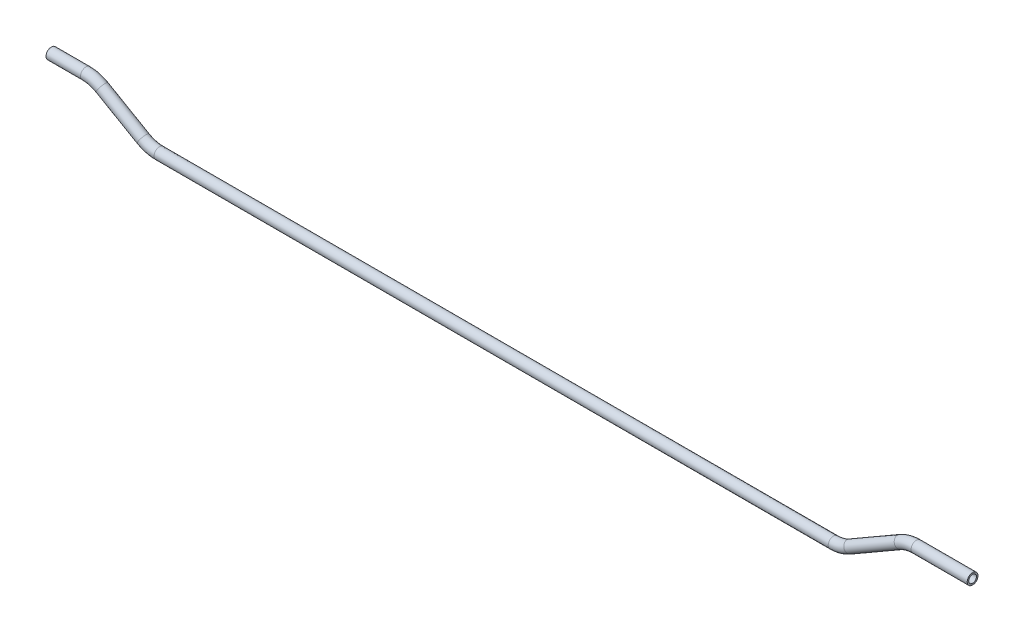
ISO-10303-21;
HEADER;
FILE_DESCRIPTION(('STEP AP214'),'2;1');
FILE_NAME('part.step','',(''),(''),'','','');
FILE_SCHEMA(('AUTOMOTIVE_DESIGN { 1 0 10303 214 1 1 1 1 }'));
ENDSEC;
DATA;
#1=APPLICATION_CONTEXT('core data for automotive mechanical design processes');
#2=APPLICATION_PROTOCOL_DEFINITION('international standard','automotive_design',2000,#1);
#3=PRODUCT_CONTEXT('',#1,'mechanical');
#4=PRODUCT('Part','Part','',(#3));
#5=PRODUCT_RELATED_PRODUCT_CATEGORY('part','',(#4));
#6=PRODUCT_DEFINITION_FORMATION('','',#4);
#7=PRODUCT_DEFINITION_CONTEXT('part definition',#1,'design');
#8=PRODUCT_DEFINITION('design','',#6,#7);
#9=PRODUCT_DEFINITION_SHAPE('','',#8);
#10=(LENGTH_UNIT() NAMED_UNIT(*) SI_UNIT(.MILLI.,.METRE.));
#11=(NAMED_UNIT(*) PLANE_ANGLE_UNIT() SI_UNIT($,.RADIAN.));
#12=(NAMED_UNIT(*) SI_UNIT($,.STERADIAN.) SOLID_ANGLE_UNIT());
#13=UNCERTAINTY_MEASURE_WITH_UNIT(LENGTH_MEASURE(1.E-05),#10,'distance_accuracy_value','');
#14=(GEOMETRIC_REPRESENTATION_CONTEXT(3) GLOBAL_UNCERTAINTY_ASSIGNED_CONTEXT((#13)) GLOBAL_UNIT_ASSIGNED_CONTEXT((#10,
#11,#12)) REPRESENTATION_CONTEXT('',''));
#15=CARTESIAN_POINT('',(0.,0.,0.));
#16=DIRECTION('',(0.,0.,1.));
#17=DIRECTION('',(1.,0.,0.));
#18=AXIS2_PLACEMENT_3D('',#15,#16,#17);
#19=CARTESIAN_POINT('',(-15.2007895417832,-14.7828746599777,0.));
#20=DIRECTION('',(1.,0.,0.));
#21=DIRECTION('',(0.,1.,0.));
#22=AXIS2_PLACEMENT_3D('',#19,#20,#21);
#23=CYLINDRICAL_SURFACE('',#22,3.175);
#24=CARTESIAN_POINT('',(5.0947783424039,-14.7828746599777,0.));
#25=DIRECTION('',(1.,0.,0.));
#26=DIRECTION('',(0.,1.,0.));
#27=AXIS2_PLACEMENT_3D('',#24,#25,#26);
#28=CIRCLE('',#27,3.175);
#29=CARTESIAN_POINT('',(5.0947783424039,-11.6078746599777,0.));
#30=VERTEX_POINT('',#29);
#31=EDGE_CURVE('E55',#30,#30,#28,.T.);
#32=ORIENTED_EDGE('',*,*,#31,.F.);
#33=EDGE_LOOP('',(#32));
#34=FACE_BOUND('',#33,.T.);
#35=CARTESIAN_POINT('',(-15.2007895417832,-14.7828746599777,0.));
#36=DIRECTION('',(1.,0.,0.));
#37=DIRECTION('',(0.,1.,0.));
#38=AXIS2_PLACEMENT_3D('',#35,#36,#37);
#39=CIRCLE('',#38,3.175);
#40=CARTESIAN_POINT('',(-15.2007895417832,-11.6078746599777,0.));
#41=VERTEX_POINT('',#40);
#42=EDGE_CURVE('E52',#41,#41,#39,.T.);
#43=ORIENTED_EDGE('',*,*,#42,.T.);
#44=EDGE_LOOP('',(#43));
#45=FACE_BOUND('',#44,.T.);
#46=ADVANCED_FACE('F31',(#34,#45),#23,.T.);
#47=CARTESIAN_POINT('',(5.0947783424039,-33.8328746599777,0.));
#48=DIRECTION('',(0.,0.,-1.));
#49=DIRECTION('',(-1.,0.,0.));
#50=AXIS2_PLACEMENT_3D('',#47,#48,#49);
#51=TOROIDAL_SURFACE('',#50,19.05,3.175);
#52=CARTESIAN_POINT('',(14.6197783424039,-17.3350907178842,0.));
#53=DIRECTION('',(0.866025403784438,-0.500000000000001,0.));
#54=DIRECTION('',(0.500000000000001,0.866025403784438,0.));
#55=AXIS2_PLACEMENT_3D('',#52,#53,#54);
#56=CIRCLE('',#55,3.175);
#57=CARTESIAN_POINT('',(16.2072783424039,-14.5854600608686,0.));
#58=VERTEX_POINT('',#57);
#59=EDGE_CURVE('E58',#58,#58,#56,.T.);
#60=CARTESIAN_POINT('',(5.0947783424039,-33.8328746599777,0.));
#61=DIRECTION('',(0.,0.,-1.));
#62=DIRECTION('',(-1.,0.,0.));
#63=AXIS2_PLACEMENT_3D('',#60,#61,#62);
#64=CIRCLE('',#63,22.225);
#65=EDGE_CURVE('',#30,#58,#64,.T.);
#66=ORIENTED_EDGE('',*,*,#31,.T.);
#67=ORIENTED_EDGE('',*,*,#59,.F.);
#68=ORIENTED_EDGE('',*,*,#65,.T.);
#69=ORIENTED_EDGE('',*,*,#65,.F.);
#70=EDGE_LOOP('',(#66,#68,#67,#69));
#71=FACE_BOUND('',#70,.T.);
#72=ADVANCED_FACE('F115',(#71),#51,.T.);
#73=CARTESIAN_POINT('',(14.6197783424039,-17.3350907178842,0.));
#74=DIRECTION('',(0.866025403784439,-0.499999999999999,0.));
#75=DIRECTION('',(0.499999999999999,0.866025403784439,0.));
#76=AXIS2_PLACEMENT_3D('',#73,#74,#75);
#77=CYLINDRICAL_SURFACE('',#76,3.175);
#78=CARTESIAN_POINT('',(38.7742104582168,-31.2806586020712,0.));
#79=DIRECTION('',(0.866025403784439,-0.499999999999999,0.));
#80=DIRECTION('',(0.499999999999999,0.866025403784439,0.));
#81=AXIS2_PLACEMENT_3D('',#78,#79,#80);
#82=CIRCLE('',#81,3.175);
#83=CARTESIAN_POINT('',(37.1867104582168,-34.0302892590868,0.));
#84=VERTEX_POINT('',#83);
#85=EDGE_CURVE('E61',#84,#84,#82,.T.);
#86=ORIENTED_EDGE('',*,*,#85,.F.);
#87=EDGE_LOOP('',(#86));
#88=FACE_BOUND('',#87,.T.);
#89=ORIENTED_EDGE('',*,*,#59,.T.);
#90=EDGE_LOOP('',(#89));
#91=FACE_BOUND('',#90,.T.);
#92=ADVANCED_FACE('F119',(#88,#91),#77,.T.);
#93=CARTESIAN_POINT('',(48.2992104582168,-14.7828746599777,0.));
#94=DIRECTION('',(0.,0.,1.));
#95=DIRECTION('',(1.,0.,0.));
#96=AXIS2_PLACEMENT_3D('',#93,#94,#95);
#97=TOROIDAL_SURFACE('',#96,19.05,3.175);
#98=CARTESIAN_POINT('',(48.2992104582168,-33.8328746599777,0.));
#99=DIRECTION('',(1.,0.,0.));
#100=DIRECTION('',(0.,1.,0.));
#101=AXIS2_PLACEMENT_3D('',#98,#99,#100);
#102=CIRCLE('',#101,3.175);
#103=CARTESIAN_POINT('',(48.2992104582168,-37.0078746599777,0.));
#104=VERTEX_POINT('',#103);
#105=EDGE_CURVE('E64',#104,#104,#102,.T.);
#106=CARTESIAN_POINT('',(48.2992104582168,-14.7828746599777,0.));
#107=DIRECTION('',(0.,0.,1.));
#108=DIRECTION('',(1.,0.,0.));
#109=AXIS2_PLACEMENT_3D('',#106,#107,#108);
#110=CIRCLE('',#109,22.225);
#111=EDGE_CURVE('',#84,#104,#110,.T.);
#112=ORIENTED_EDGE('',*,*,#85,.T.);
#113=ORIENTED_EDGE('',*,*,#105,.F.);
#114=ORIENTED_EDGE('',*,*,#111,.T.);
#115=ORIENTED_EDGE('',*,*,#111,.F.);
#116=EDGE_LOOP('',(#112,#114,#113,#115));
#117=FACE_BOUND('',#116,.T.);
#118=ADVANCED_FACE('F123',(#117),#97,.T.);
#119=CARTESIAN_POINT('',(48.2992104582168,-33.8328746599777,0.));
#120=DIRECTION('',(1.,0.,0.));
#121=DIRECTION('',(0.,1.,0.));
#122=AXIS2_PLACEMENT_3D('',#119,#120,#121);
#123=CYLINDRICAL_SURFACE('',#122,3.175);
#124=CARTESIAN_POINT('',(444.490346226591,-33.8328746599776,0.));
#125=DIRECTION('',(1.,0.,0.));
#126=DIRECTION('',(0.,1.,0.));
#127=AXIS2_PLACEMENT_3D('',#124,#125,#126);
#128=CIRCLE('',#127,3.175);
#129=CARTESIAN_POINT('',(444.490346226591,-37.0078746599776,0.));
#130=VERTEX_POINT('',#129);
#131=EDGE_CURVE('E67',#130,#130,#128,.T.);
#132=ORIENTED_EDGE('',*,*,#131,.F.);
#133=EDGE_LOOP('',(#132));
#134=FACE_BOUND('',#133,.T.);
#135=ORIENTED_EDGE('',*,*,#105,.T.);
#136=EDGE_LOOP('',(#135));
#137=FACE_BOUND('',#136,.T.);
#138=ADVANCED_FACE('F127',(#134,#137),#123,.T.);
#139=CARTESIAN_POINT('',(444.490346226591,-14.7828746599776,0.));
#140=DIRECTION('',(0.,0.,1.));
#141=DIRECTION('',(1.,0.,0.));
#142=AXIS2_PLACEMENT_3D('',#139,#140,#141);
#143=TOROIDAL_SURFACE('',#142,19.05,3.175);
#144=CARTESIAN_POINT('',(454.015346226591,-31.2806586020711,0.));
#145=DIRECTION('',(0.866025403784438,0.5,0.));
#146=DIRECTION('',(-0.5,0.866025403784438,0.));
#147=AXIS2_PLACEMENT_3D('',#144,#145,#146);
#148=CIRCLE('',#147,3.175);
#149=CARTESIAN_POINT('',(455.602846226591,-34.0302892590867,0.));
#150=VERTEX_POINT('',#149);
#151=EDGE_CURVE('E70',#150,#150,#148,.T.);
#152=CARTESIAN_POINT('',(444.490346226591,-14.7828746599776,0.));
#153=DIRECTION('',(0.,0.,1.));
#154=DIRECTION('',(1.,0.,0.));
#155=AXIS2_PLACEMENT_3D('',#152,#153,#154);
#156=CIRCLE('',#155,22.225);
#157=EDGE_CURVE('',#130,#150,#156,.T.);
#158=ORIENTED_EDGE('',*,*,#131,.T.);
#159=ORIENTED_EDGE('',*,*,#151,.F.);
#160=ORIENTED_EDGE('',*,*,#157,.T.);
#161=ORIENTED_EDGE('',*,*,#157,.F.);
#162=EDGE_LOOP('',(#158,#160,#159,#161));
#163=FACE_BOUND('',#162,.T.);
#164=ADVANCED_FACE('F89',(#163),#143,.T.);
#165=CARTESIAN_POINT('',(454.015346226591,-31.2806586020711,0.));
#166=DIRECTION('',(0.866025403784438,0.500000000000001,0.));
#167=DIRECTION('',(-0.500000000000001,0.866025403784438,0.));
#168=AXIS2_PLACEMENT_3D('',#165,#166,#167);
#169=CYLINDRICAL_SURFACE('',#168,3.175);
#170=CARTESIAN_POINT('',(483.669039656435,-14.1600907178841,0.));
#171=DIRECTION('',(0.866025403784438,0.500000000000001,0.));
#172=DIRECTION('',(-0.500000000000001,0.866025403784438,0.));
#173=AXIS2_PLACEMENT_3D('',#170,#171,#172);
#174=CIRCLE('',#173,3.175);
#175=CARTESIAN_POINT('',(482.081539656435,-11.4104600608685,0.));
#176=VERTEX_POINT('',#175);
#177=EDGE_CURVE('E72',#176,#176,#174,.T.);
#178=ORIENTED_EDGE('',*,*,#177,.F.);
#179=EDGE_LOOP('',(#178));
#180=FACE_BOUND('',#179,.T.);
#181=ORIENTED_EDGE('',*,*,#151,.T.);
#182=EDGE_LOOP('',(#181));
#183=FACE_BOUND('',#182,.T.);
#184=ADVANCED_FACE('F82',(#180,#183),#169,.T.);
#185=CARTESIAN_POINT('',(493.194039656435,-30.6578746599776,0.));
#186=DIRECTION('',(0.,0.,-1.));
#187=DIRECTION('',(-1.,0.,0.));
#188=AXIS2_PLACEMENT_3D('',#185,#186,#187);
#189=TOROIDAL_SURFACE('',#188,19.05,3.175);
#190=CARTESIAN_POINT('',(493.194039656435,-11.6078746599776,0.));
#191=DIRECTION('',(1.,0.,0.));
#192=DIRECTION('',(0.,1.,0.));
#193=AXIS2_PLACEMENT_3D('',#190,#191,#192);
#194=CIRCLE('',#193,3.175);
#195=CARTESIAN_POINT('',(493.194039656435,-8.43287465997765,0.));
#196=VERTEX_POINT('',#195);
#197=EDGE_CURVE('E35',#196,#196,#194,.T.);
#198=CARTESIAN_POINT('',(493.194039656435,-30.6578746599776,0.));
#199=DIRECTION('',(0.,0.,-1.));
#200=DIRECTION('',(-1.,0.,0.));
#201=AXIS2_PLACEMENT_3D('',#198,#199,#200);
#202=CIRCLE('',#201,22.225);
#203=EDGE_CURVE('',#176,#196,#202,.T.);
#204=ORIENTED_EDGE('',*,*,#177,.T.);
#205=ORIENTED_EDGE('',*,*,#197,.F.);
#206=ORIENTED_EDGE('',*,*,#203,.T.);
#207=ORIENTED_EDGE('',*,*,#203,.F.);
#208=EDGE_LOOP('',(#204,#206,#205,#207));
#209=FACE_BOUND('',#208,.T.);
#210=ADVANCED_FACE('F80',(#209),#189,.T.);
#211=CARTESIAN_POINT('',(493.194039656435,-11.6078746599776,0.));
#212=DIRECTION('',(1.,0.,0.));
#213=DIRECTION('',(0.,1.,0.));
#214=AXIS2_PLACEMENT_3D('',#211,#212,#213);
#215=CYLINDRICAL_SURFACE('',#214,3.175);
#216=CARTESIAN_POINT('',(526.189607540622,-11.6078746599776,0.));
#217=DIRECTION('',(1.,0.,0.));
#218=DIRECTION('',(0.,1.,0.));
#219=AXIS2_PLACEMENT_3D('',#216,#217,#218);
#220=CIRCLE('',#219,3.175);
#221=CARTESIAN_POINT('',(526.189607540622,-8.43287465997762,0.));
#222=VERTEX_POINT('',#221);
#223=EDGE_CURVE('E48',#222,#222,#220,.T.);
#224=ORIENTED_EDGE('',*,*,#223,.F.);
#225=EDGE_LOOP('',(#224));
#226=FACE_BOUND('',#225,.T.);
#227=ORIENTED_EDGE('',*,*,#197,.T.);
#228=EDGE_LOOP('',(#227));
#229=FACE_BOUND('',#228,.T.);
#230=ADVANCED_FACE('F33',(#226,#229),#215,.T.);
#231=CARTESIAN_POINT('',(-15.2007895417832,-14.7828746599777,0.));
#232=DIRECTION('',(1.,0.,0.));
#233=DIRECTION('',(0.,1.,0.));
#234=AXIS2_PLACEMENT_3D('',#231,#232,#233);
#235=PLANE('',#234);
#236=CARTESIAN_POINT('',(-15.2007895417832,-14.7828746599777,0.));
#237=DIRECTION('',(1.,0.,0.));
#238=DIRECTION('',(0.,1.,0.));
#239=AXIS2_PLACEMENT_3D('',#236,#237,#238);
#240=CIRCLE('',#239,2.286);
#241=CARTESIAN_POINT('',(-15.2007895417832,-12.4968746599777,0.));
#242=VERTEX_POINT('',#241);
#243=EDGE_CURVE('E51',#242,#242,#240,.F.);
#244=ORIENTED_EDGE('',*,*,#243,.F.);
#245=EDGE_LOOP('',(#244));
#246=FACE_BOUND('',#245,.T.);
#247=ORIENTED_EDGE('',*,*,#42,.F.);
#248=EDGE_LOOP('',(#247));
#249=FACE_BOUND('',#248,.T.);
#250=ADVANCED_FACE('F87',(#246,#249),#235,.F.);
#251=CARTESIAN_POINT('',(526.189607540622,-11.6078746599776,0.));
#252=DIRECTION('',(1.,0.,0.));
#253=DIRECTION('',(0.,1.,0.));
#254=AXIS2_PLACEMENT_3D('',#251,#252,#253);
#255=PLANE('',#254);
#256=CARTESIAN_POINT('',(526.189607540622,-11.6078746599776,0.));
#257=DIRECTION('',(1.,0.,0.));
#258=DIRECTION('',(0.,1.,0.));
#259=AXIS2_PLACEMENT_3D('',#256,#257,#258);
#260=CIRCLE('',#259,2.286);
#261=CARTESIAN_POINT('',(526.189607540622,-9.32187465997763,0.));
#262=VERTEX_POINT('',#261);
#263=EDGE_CURVE('E10',#262,#262,#260,.F.);
#264=ORIENTED_EDGE('',*,*,#263,.T.);
#265=EDGE_LOOP('',(#264));
#266=FACE_BOUND('',#265,.T.);
#267=ORIENTED_EDGE('',*,*,#223,.T.);
#268=EDGE_LOOP('',(#267));
#269=FACE_BOUND('',#268,.T.);
#270=ADVANCED_FACE('F106',(#266,#269),#255,.T.);
#271=CARTESIAN_POINT('',(-15.2007895417832,-14.7828746599777,0.));
#272=DIRECTION('',(1.,0.,0.));
#273=DIRECTION('',(0.,1.,0.));
#274=AXIS2_PLACEMENT_3D('',#271,#272,#273);
#275=CYLINDRICAL_SURFACE('',#274,2.286);
#276=CARTESIAN_POINT('',(5.0947783424039,-14.7828746599777,0.));
#277=DIRECTION('',(1.,0.,0.));
#278=DIRECTION('',(0.,1.,0.));
#279=AXIS2_PLACEMENT_3D('',#276,#277,#278);
#280=CIRCLE('',#279,2.286);
#281=CARTESIAN_POINT('',(5.0947783424039,-12.4968746599777,0.));
#282=VERTEX_POINT('',#281);
#283=EDGE_CURVE('E280',#282,#282,#280,.F.);
#284=ORIENTED_EDGE('',*,*,#283,.F.);
#285=EDGE_LOOP('',(#284));
#286=FACE_BOUND('',#285,.T.);
#287=ORIENTED_EDGE('',*,*,#243,.T.);
#288=EDGE_LOOP('',(#287));
#289=FACE_BOUND('',#288,.T.);
#290=ADVANCED_FACE('F109',(#286,#289),#275,.F.);
#291=CARTESIAN_POINT('',(5.0947783424039,-33.8328746599777,0.));
#292=DIRECTION('',(0.,0.,-1.));
#293=DIRECTION('',(-1.,0.,0.));
#294=AXIS2_PLACEMENT_3D('',#291,#292,#293);
#295=TOROIDAL_SURFACE('',#294,19.05,2.286);
#296=CARTESIAN_POINT('',(14.6197783424039,-17.3350907178842,0.));
#297=DIRECTION('',(0.866025403784438,-0.500000000000001,0.));
#298=DIRECTION('',(0.500000000000001,0.866025403784438,0.));
#299=AXIS2_PLACEMENT_3D('',#296,#297,#298);
#300=CIRCLE('',#299,2.286);
#301=CARTESIAN_POINT('',(15.7627783424039,-15.3553566448329,0.));
#302=VERTEX_POINT('',#301);
#303=EDGE_CURVE('E277',#302,#302,#300,.F.);
#304=CARTESIAN_POINT('',(5.0947783424039,-33.8328746599777,0.));
#305=DIRECTION('',(0.,0.,-1.));
#306=DIRECTION('',(-1.,0.,0.));
#307=AXIS2_PLACEMENT_3D('',#304,#305,#306);
#308=CIRCLE('',#307,21.336);
#309=EDGE_CURVE('',#282,#302,#308,.T.);
#310=ORIENTED_EDGE('',*,*,#283,.T.);
#311=ORIENTED_EDGE('',*,*,#303,.F.);
#312=ORIENTED_EDGE('',*,*,#309,.T.);
#313=ORIENTED_EDGE('',*,*,#309,.F.);
#314=EDGE_LOOP('',(#310,#312,#311,#313));
#315=FACE_BOUND('',#314,.T.);
#316=ADVANCED_FACE('F188',(#315),#295,.F.);
#317=CARTESIAN_POINT('',(14.6197783424039,-17.3350907178842,0.));
#318=DIRECTION('',(0.866025403784439,-0.499999999999999,0.));
#319=DIRECTION('',(0.499999999999999,0.866025403784439,0.));
#320=AXIS2_PLACEMENT_3D('',#317,#318,#319);
#321=CYLINDRICAL_SURFACE('',#320,2.286);
#322=CARTESIAN_POINT('',(38.7742104582168,-31.2806586020712,0.));
#323=DIRECTION('',(0.866025403784439,-0.499999999999999,0.));
#324=DIRECTION('',(0.499999999999999,0.866025403784439,0.));
#325=AXIS2_PLACEMENT_3D('',#322,#323,#324);
#326=CIRCLE('',#325,2.286);
#327=CARTESIAN_POINT('',(37.6312104582168,-33.2603926751225,0.));
#328=VERTEX_POINT('',#327);
#329=EDGE_CURVE('E274',#328,#328,#326,.F.);
#330=ORIENTED_EDGE('',*,*,#329,.F.);
#331=EDGE_LOOP('',(#330));
#332=FACE_BOUND('',#331,.T.);
#333=ORIENTED_EDGE('',*,*,#303,.T.);
#334=EDGE_LOOP('',(#333));
#335=FACE_BOUND('',#334,.T.);
#336=ADVANCED_FACE('F198',(#332,#335),#321,.F.);
#337=CARTESIAN_POINT('',(48.2992104582168,-14.7828746599777,0.));
#338=DIRECTION('',(0.,0.,1.));
#339=DIRECTION('',(1.,0.,0.));
#340=AXIS2_PLACEMENT_3D('',#337,#338,#339);
#341=TOROIDAL_SURFACE('',#340,19.05,2.286);
#342=CARTESIAN_POINT('',(48.2992104582168,-33.8328746599777,0.));
#343=DIRECTION('',(1.,0.,0.));
#344=DIRECTION('',(0.,1.,0.));
#345=AXIS2_PLACEMENT_3D('',#342,#343,#344);
#346=CIRCLE('',#345,2.286);
#347=CARTESIAN_POINT('',(48.2992104582168,-36.1188746599777,0.));
#348=VERTEX_POINT('',#347);
#349=EDGE_CURVE('E269',#348,#348,#346,.F.);
#350=CARTESIAN_POINT('',(48.2992104582168,-14.7828746599777,0.));
#351=DIRECTION('',(0.,0.,1.));
#352=DIRECTION('',(1.,0.,0.));
#353=AXIS2_PLACEMENT_3D('',#350,#351,#352);
#354=CIRCLE('',#353,21.336);
#355=EDGE_CURVE('',#328,#348,#354,.T.);
#356=ORIENTED_EDGE('',*,*,#329,.T.);
#357=ORIENTED_EDGE('',*,*,#349,.F.);
#358=ORIENTED_EDGE('',*,*,#355,.T.);
#359=ORIENTED_EDGE('',*,*,#355,.F.);
#360=EDGE_LOOP('',(#356,#358,#357,#359));
#361=FACE_BOUND('',#360,.T.);
#362=ADVANCED_FACE('F208',(#361),#341,.F.);
#363=CARTESIAN_POINT('',(48.2992104582168,-33.8328746599777,0.));
#364=DIRECTION('',(1.,0.,0.));
#365=DIRECTION('',(0.,1.,0.));
#366=AXIS2_PLACEMENT_3D('',#363,#364,#365);
#367=CYLINDRICAL_SURFACE('',#366,2.286);
#368=CARTESIAN_POINT('',(444.490346226591,-33.8328746599776,0.));
#369=DIRECTION('',(1.,0.,0.));
#370=DIRECTION('',(0.,1.,0.));
#371=AXIS2_PLACEMENT_3D('',#368,#369,#370);
#372=CIRCLE('',#371,2.286);
#373=CARTESIAN_POINT('',(444.490346226591,-36.1188746599776,0.));
#374=VERTEX_POINT('',#373);
#375=EDGE_CURVE('E266',#374,#374,#372,.F.);
#376=ORIENTED_EDGE('',*,*,#375,.F.);
#377=EDGE_LOOP('',(#376));
#378=FACE_BOUND('',#377,.T.);
#379=ORIENTED_EDGE('',*,*,#349,.T.);
#380=EDGE_LOOP('',(#379));
#381=FACE_BOUND('',#380,.T.);
#382=ADVANCED_FACE('F218',(#378,#381),#367,.F.);
#383=CARTESIAN_POINT('',(444.490346226591,-14.7828746599776,0.));
#384=DIRECTION('',(0.,0.,1.));
#385=DIRECTION('',(1.,0.,0.));
#386=AXIS2_PLACEMENT_3D('',#383,#384,#385);
#387=TOROIDAL_SURFACE('',#386,19.05,2.286);
#388=CARTESIAN_POINT('',(454.015346226591,-31.2806586020711,0.));
#389=DIRECTION('',(0.866025403784438,0.5,0.));
#390=DIRECTION('',(-0.5,0.866025403784438,0.));
#391=AXIS2_PLACEMENT_3D('',#388,#389,#390);
#392=CIRCLE('',#391,2.286);
#393=CARTESIAN_POINT('',(455.158346226591,-33.2603926751223,0.));
#394=VERTEX_POINT('',#393);
#395=EDGE_CURVE('E265',#394,#394,#392,.F.);
#396=CARTESIAN_POINT('',(444.490346226591,-14.7828746599776,0.));
#397=DIRECTION('',(0.,0.,1.));
#398=DIRECTION('',(1.,0.,0.));
#399=AXIS2_PLACEMENT_3D('',#396,#397,#398);
#400=CIRCLE('',#399,21.336);
#401=EDGE_CURVE('',#374,#394,#400,.T.);
#402=ORIENTED_EDGE('',*,*,#375,.T.);
#403=ORIENTED_EDGE('',*,*,#395,.F.);
#404=ORIENTED_EDGE('',*,*,#401,.T.);
#405=ORIENTED_EDGE('',*,*,#401,.F.);
#406=EDGE_LOOP('',(#402,#404,#403,#405));
#407=FACE_BOUND('',#406,.T.);
#408=ADVANCED_FACE('F228',(#407),#387,.F.);
#409=CARTESIAN_POINT('',(454.015346226591,-31.2806586020711,0.));
#410=DIRECTION('',(0.866025403784438,0.500000000000001,0.));
#411=DIRECTION('',(-0.500000000000001,0.866025403784438,0.));
#412=AXIS2_PLACEMENT_3D('',#409,#410,#411);
#413=CYLINDRICAL_SURFACE('',#412,2.286);
#414=CARTESIAN_POINT('',(483.669039656435,-14.1600907178841,0.));
#415=DIRECTION('',(0.866025403784438,0.500000000000001,0.));
#416=DIRECTION('',(-0.500000000000001,0.866025403784438,0.));
#417=AXIS2_PLACEMENT_3D('',#414,#415,#416);
#418=CIRCLE('',#417,2.286);
#419=CARTESIAN_POINT('',(482.526039656435,-12.1803566448329,0.));
#420=VERTEX_POINT('',#419);
#421=EDGE_CURVE('E44',#420,#420,#418,.F.);
#422=ORIENTED_EDGE('',*,*,#421,.F.);
#423=EDGE_LOOP('',(#422));
#424=FACE_BOUND('',#423,.T.);
#425=ORIENTED_EDGE('',*,*,#395,.T.);
#426=EDGE_LOOP('',(#425));
#427=FACE_BOUND('',#426,.T.);
#428=ADVANCED_FACE('F100',(#424,#427),#413,.F.);
#429=CARTESIAN_POINT('',(493.194039656435,-30.6578746599776,0.));
#430=DIRECTION('',(0.,0.,-1.));
#431=DIRECTION('',(-1.,0.,0.));
#432=AXIS2_PLACEMENT_3D('',#429,#430,#431);
#433=TOROIDAL_SURFACE('',#432,19.05,2.286);
#434=CARTESIAN_POINT('',(493.194039656435,-11.6078746599776,0.));
#435=DIRECTION('',(1.,0.,0.));
#436=DIRECTION('',(0.,1.,0.));
#437=AXIS2_PLACEMENT_3D('',#434,#435,#436);
#438=CIRCLE('',#437,2.286);
#439=CARTESIAN_POINT('',(493.194039656435,-9.32187465997765,0.));
#440=VERTEX_POINT('',#439);
#441=EDGE_CURVE('E39',#440,#440,#438,.F.);
#442=CARTESIAN_POINT('',(493.194039656435,-30.6578746599776,0.));
#443=DIRECTION('',(0.,0.,-1.));
#444=DIRECTION('',(-1.,0.,0.));
#445=AXIS2_PLACEMENT_3D('',#442,#443,#444);
#446=CIRCLE('',#445,21.336);
#447=EDGE_CURVE('',#420,#440,#446,.T.);
#448=ORIENTED_EDGE('',*,*,#421,.T.);
#449=ORIENTED_EDGE('',*,*,#441,.F.);
#450=ORIENTED_EDGE('',*,*,#447,.T.);
#451=ORIENTED_EDGE('',*,*,#447,.F.);
#452=EDGE_LOOP('',(#448,#450,#449,#451));
#453=FACE_BOUND('',#452,.T.);
#454=ADVANCED_FACE('F94',(#453),#433,.F.);
#455=CARTESIAN_POINT('',(493.194039656435,-11.6078746599776,0.));
#456=DIRECTION('',(1.,0.,0.));
#457=DIRECTION('',(0.,1.,0.));
#458=AXIS2_PLACEMENT_3D('',#455,#456,#457);
#459=CYLINDRICAL_SURFACE('',#458,2.286);
#460=ORIENTED_EDGE('',*,*,#263,.F.);
#461=EDGE_LOOP('',(#460));
#462=FACE_BOUND('',#461,.T.);
#463=ORIENTED_EDGE('',*,*,#441,.T.);
#464=EDGE_LOOP('',(#463));
#465=FACE_BOUND('',#464,.T.);
#466=ADVANCED_FACE('F92',(#462,#465),#459,.F.);
#467=CLOSED_SHELL('',(#46,#72,#92,#118,#138,#164,#184,#210,#230,#250,#270,#290,#316,#336,#362,
#382,#408,#428,#454,#466));
#468=MANIFOLD_SOLID_BREP('B2',#467);
#469=ADVANCED_BREP_SHAPE_REPRESENTATION('',(#18,#468),#14);
#470=SHAPE_DEFINITION_REPRESENTATION(#9,#469);
ENDSEC;
END-ISO-10303-21;
